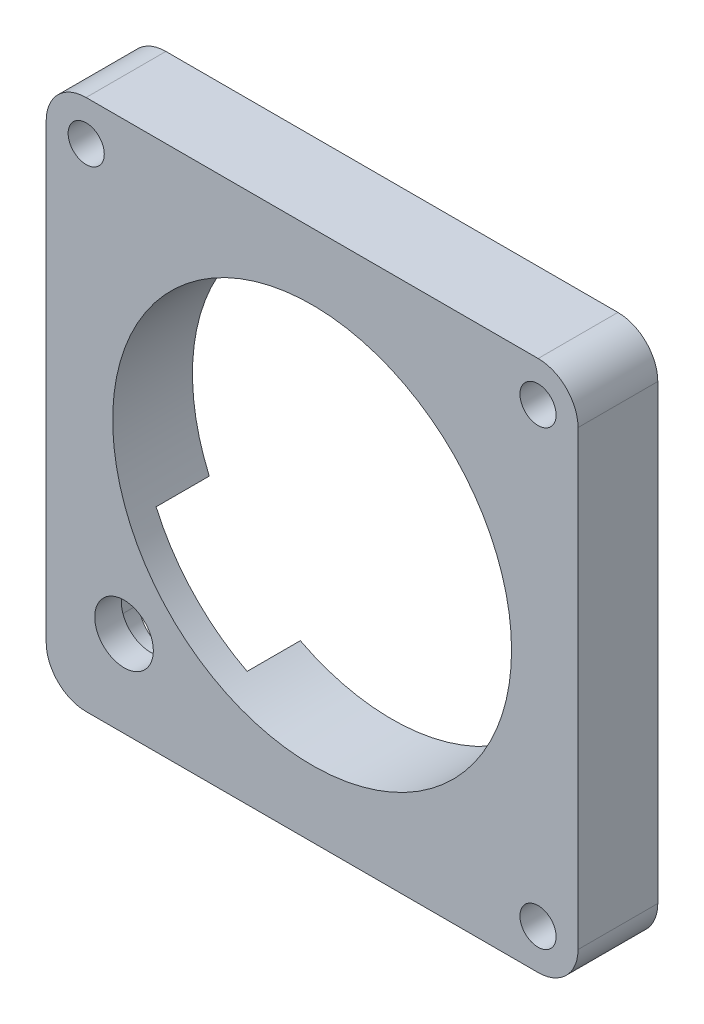
ISO-10303-21;
HEADER;
FILE_DESCRIPTION(('STEP AP214'),'2;1');
FILE_NAME('part.step','',(''),(''),'','','');
FILE_SCHEMA(('AUTOMOTIVE_DESIGN { 1 0 10303 214 1 1 1 1 }'));
ENDSEC;
DATA;
#1=APPLICATION_CONTEXT('core data for automotive mechanical design processes');
#2=APPLICATION_PROTOCOL_DEFINITION('international standard','automotive_design',2000,#1);
#3=PRODUCT_CONTEXT('',#1,'mechanical');
#4=PRODUCT('Part','Part','',(#3));
#5=PRODUCT_RELATED_PRODUCT_CATEGORY('part','',(#4));
#6=PRODUCT_DEFINITION_FORMATION('','',#4);
#7=PRODUCT_DEFINITION_CONTEXT('part definition',#1,'design');
#8=PRODUCT_DEFINITION('design','',#6,#7);
#9=PRODUCT_DEFINITION_SHAPE('','',#8);
#10=(LENGTH_UNIT() NAMED_UNIT(*) SI_UNIT(.MILLI.,.METRE.));
#11=(NAMED_UNIT(*) PLANE_ANGLE_UNIT() SI_UNIT($,.RADIAN.));
#12=(NAMED_UNIT(*) SI_UNIT($,.STERADIAN.) SOLID_ANGLE_UNIT());
#13=UNCERTAINTY_MEASURE_WITH_UNIT(LENGTH_MEASURE(1.E-05),#10,'distance_accuracy_value','');
#14=(GEOMETRIC_REPRESENTATION_CONTEXT(3) GLOBAL_UNCERTAINTY_ASSIGNED_CONTEXT((#13)) GLOBAL_UNIT_ASSIGNED_CONTEXT((#10,
#11,#12)) REPRESENTATION_CONTEXT('',''));
#15=CARTESIAN_POINT('',(0.,0.,0.));
#16=DIRECTION('',(0.,0.,1.));
#17=DIRECTION('',(1.,0.,0.));
#18=AXIS2_PLACEMENT_3D('',#15,#16,#17);
#19=CARTESIAN_POINT('',(-26.9748000000013,26.9748,9.52500000000001));
#20=DIRECTION('',(0.,0.,-1.));
#21=DIRECTION('',(-1.,0.,0.));
#22=AXIS2_PLACEMENT_3D('',#19,#20,#21);
#23=CYLINDRICAL_SURFACE('',#22,2.159);
#24=CARTESIAN_POINT('',(-26.9748000000013,26.9748,9.52500000000001));
#25=DIRECTION('',(0.,0.,1.));
#26=DIRECTION('',(1.,0.,0.));
#27=AXIS2_PLACEMENT_3D('',#24,#25,#26);
#28=CIRCLE('',#27,2.159);
#29=CARTESIAN_POINT('',(-24.8158000000013,26.9748,9.52500000000001));
#30=VERTEX_POINT('',#29);
#31=EDGE_CURVE('E261',#30,#30,#28,.T.);
#32=ORIENTED_EDGE('',*,*,#31,.T.);
#33=EDGE_LOOP('',(#32));
#34=FACE_BOUND('',#33,.T.);
#35=CARTESIAN_POINT('',(-26.9748000000013,26.9748,0.));
#36=DIRECTION('',(0.,0.,1.));
#37=DIRECTION('',(1.,0.,0.));
#38=AXIS2_PLACEMENT_3D('',#35,#36,#37);
#39=CIRCLE('',#38,2.159);
#40=CARTESIAN_POINT('',(-24.8158000000013,26.9748,0.));
#41=VERTEX_POINT('',#40);
#42=EDGE_CURVE('E258',#41,#41,#39,.T.);
#43=ORIENTED_EDGE('',*,*,#42,.F.);
#44=EDGE_LOOP('',(#43));
#45=FACE_BOUND('',#44,.T.);
#46=ADVANCED_FACE('F58',(#34,#45),#23,.F.);
#47=CARTESIAN_POINT('',(26.9748000000016,26.9747999999997,9.52500000000001));
#48=DIRECTION('',(0.,0.,-1.));
#49=DIRECTION('',(-1.,0.,0.));
#50=AXIS2_PLACEMENT_3D('',#47,#48,#49);
#51=CYLINDRICAL_SURFACE('',#50,2.15900000000011);
#52=CARTESIAN_POINT('',(26.9748000000016,26.9747999999997,9.52500000000001));
#53=DIRECTION('',(0.,0.,1.));
#54=DIRECTION('',(1.,0.,0.));
#55=AXIS2_PLACEMENT_3D('',#52,#53,#54);
#56=CIRCLE('',#55,2.15900000000011);
#57=CARTESIAN_POINT('',(29.1338000000017,26.9747999999997,9.52500000000001));
#58=VERTEX_POINT('',#57);
#59=EDGE_CURVE('E257',#58,#58,#56,.T.);
#60=ORIENTED_EDGE('',*,*,#59,.T.);
#61=EDGE_LOOP('',(#60));
#62=FACE_BOUND('',#61,.T.);
#63=CARTESIAN_POINT('',(26.9748000000016,26.9747999999997,0.));
#64=DIRECTION('',(0.,0.,1.));
#65=DIRECTION('',(1.,0.,0.));
#66=AXIS2_PLACEMENT_3D('',#63,#64,#65);
#67=CIRCLE('',#66,2.15900000000011);
#68=CARTESIAN_POINT('',(29.1338000000017,26.9747999999997,0.));
#69=VERTEX_POINT('',#68);
#70=EDGE_CURVE('E266',#69,#69,#67,.T.);
#71=ORIENTED_EDGE('',*,*,#70,.F.);
#72=EDGE_LOOP('',(#71));
#73=FACE_BOUND('',#72,.T.);
#74=ADVANCED_FACE('F328',(#62,#73),#51,.F.);
#75=CARTESIAN_POINT('',(26.9747999999981,-26.9748000000032,9.52500000000001));
#76=DIRECTION('',(0.,0.,-1.));
#77=DIRECTION('',(-1.,0.,0.));
#78=AXIS2_PLACEMENT_3D('',#75,#76,#77);
#79=CYLINDRICAL_SURFACE('',#78,2.159);
#80=CARTESIAN_POINT('',(26.9747999999981,-26.9748000000032,9.52500000000001));
#81=DIRECTION('',(0.,0.,1.));
#82=DIRECTION('',(1.,0.,0.));
#83=AXIS2_PLACEMENT_3D('',#80,#81,#82);
#84=CIRCLE('',#83,2.159);
#85=CARTESIAN_POINT('',(29.1337999999981,-26.9748000000032,9.52500000000001));
#86=VERTEX_POINT('',#85);
#87=EDGE_CURVE('E254',#86,#86,#84,.T.);
#88=ORIENTED_EDGE('',*,*,#87,.T.);
#89=EDGE_LOOP('',(#88));
#90=FACE_BOUND('',#89,.T.);
#91=CARTESIAN_POINT('',(26.9747999999981,-26.9748000000032,0.));
#92=DIRECTION('',(0.,0.,1.));
#93=DIRECTION('',(1.,0.,0.));
#94=AXIS2_PLACEMENT_3D('',#91,#92,#93);
#95=CIRCLE('',#94,2.159);
#96=CARTESIAN_POINT('',(29.1337999999981,-26.9748000000032,0.));
#97=VERTEX_POINT('',#96);
#98=EDGE_CURVE('E253',#97,#97,#95,.T.);
#99=ORIENTED_EDGE('',*,*,#98,.F.);
#100=EDGE_LOOP('',(#99));
#101=FACE_BOUND('',#100,.T.);
#102=ADVANCED_FACE('F60',(#90,#101),#79,.F.);
#103=CARTESIAN_POINT('',(0.,0.,9.52500000000001));
#104=DIRECTION('',(0.,0.,1.));
#105=DIRECTION('',(1.,0.,0.));
#106=AXIS2_PLACEMENT_3D('',#103,#104,#105);
#107=PLANE('',#106);
#108=CARTESIAN_POINT('',(-22.455957980456,-21.4503,9.52500000000001));
#109=DIRECTION('',(0.,0.,1.));
#110=DIRECTION('',(1.,0.,0.));
#111=AXIS2_PLACEMENT_3D('',#108,#109,#110);
#112=CIRCLE('',#111,3.5);
#113=CARTESIAN_POINT('',(-18.955957980456,-21.4503,9.52500000000001));
#114=VERTEX_POINT('',#113);
#115=EDGE_CURVE('E247',#114,#114,#112,.T.);
#116=ORIENTED_EDGE('',*,*,#115,.F.);
#117=EDGE_LOOP('',(#116));
#118=FACE_BOUND('',#117,.T.);
#119=ORIENTED_EDGE('',*,*,#87,.F.);
#120=EDGE_LOOP('',(#119));
#121=FACE_BOUND('',#120,.T.);
#122=ORIENTED_EDGE('',*,*,#59,.F.);
#123=EDGE_LOOP('',(#122));
#124=FACE_BOUND('',#123,.T.);
#125=ORIENTED_EDGE('',*,*,#31,.F.);
#126=EDGE_LOOP('',(#125));
#127=FACE_BOUND('',#126,.T.);
#128=CARTESIAN_POINT('',(0.,0.,9.52500000000001));
#129=DIRECTION('',(0.,0.,1.));
#130=DIRECTION('',(1.,0.,0.));
#131=AXIS2_PLACEMENT_3D('',#128,#129,#130);
#132=CIRCLE('',#131,23.8125);
#133=CARTESIAN_POINT('',(23.8125,0.,9.52500000000001));
#134=VERTEX_POINT('',#133);
#135=EDGE_CURVE('E250',#134,#134,#132,.T.);
#136=ORIENTED_EDGE('',*,*,#135,.F.);
#137=EDGE_LOOP('',(#136));
#138=FACE_BOUND('',#137,.T.);
#139=CARTESIAN_POINT('',(26.9875000000011,26.9875,9.52500000000001));
#140=DIRECTION('',(0.,0.,1.));
#141=DIRECTION('',(1.,0.,0.));
#142=AXIS2_PLACEMENT_3D('',#139,#140,#141);
#143=CIRCLE('',#142,4.7625);
#144=CARTESIAN_POINT('',(31.7500000000011,26.9875,9.52500000000001));
#145=VERTEX_POINT('',#144);
#146=CARTESIAN_POINT('',(26.9875000000011,31.75,9.52500000000001));
#147=VERTEX_POINT('',#146);
#148=EDGE_CURVE('E165',#145,#147,#143,.T.);
#149=ORIENTED_EDGE('',*,*,#148,.T.);
#150=DIRECTION('',(-1.,0.,0.));
#151=VECTOR('',#150,1.);
#152=CARTESIAN_POINT('',(26.9875000000011,31.75,9.52500000000001));
#153=LINE('',#152,#151);
#154=CARTESIAN_POINT('',(-26.9875000000011,31.75,9.52500000000001));
#155=VERTEX_POINT('',#154);
#156=EDGE_CURVE('E174',#147,#155,#153,.T.);
#157=ORIENTED_EDGE('',*,*,#156,.T.);
#158=CARTESIAN_POINT('',(-26.9875000000011,26.9875,9.52500000000001));
#159=DIRECTION('',(0.,0.,1.));
#160=DIRECTION('',(1.,0.,0.));
#161=AXIS2_PLACEMENT_3D('',#158,#159,#160);
#162=CIRCLE('',#161,4.7625);
#163=CARTESIAN_POINT('',(-31.7500000000011,26.9875,9.52500000000001));
#164=VERTEX_POINT('',#163);
#165=EDGE_CURVE('E180',#155,#164,#162,.T.);
#166=ORIENTED_EDGE('',*,*,#165,.T.);
#167=DIRECTION('',(0.,-1.,0.));
#168=VECTOR('',#167,1.);
#169=CARTESIAN_POINT('',(-31.7500000000011,26.9875,9.52500000000001));
#170=LINE('',#169,#168);
#171=CARTESIAN_POINT('',(-31.7500000000011,-26.9875,9.52500000000001));
#172=VERTEX_POINT('',#171);
#173=EDGE_CURVE('E193',#164,#172,#170,.T.);
#174=ORIENTED_EDGE('',*,*,#173,.T.);
#175=CARTESIAN_POINT('',(-26.9875000000011,-26.9875,9.52500000000001));
#176=DIRECTION('',(0.,0.,1.));
#177=DIRECTION('',(1.,0.,0.));
#178=AXIS2_PLACEMENT_3D('',#175,#176,#177);
#179=CIRCLE('',#178,4.7625);
#180=CARTESIAN_POINT('',(-26.9875000000011,-31.75,9.52500000000001));
#181=VERTEX_POINT('',#180);
#182=EDGE_CURVE('E196',#172,#181,#179,.T.);
#183=ORIENTED_EDGE('',*,*,#182,.T.);
#184=DIRECTION('',(1.,0.,0.));
#185=VECTOR('',#184,1.);
#186=CARTESIAN_POINT('',(-26.9875000000011,-31.75,9.52500000000001));
#187=LINE('',#186,#185);
#188=CARTESIAN_POINT('',(26.9875000000011,-31.75,9.52500000000001));
#189=VERTEX_POINT('',#188);
#190=EDGE_CURVE('E199',#181,#189,#187,.T.);
#191=ORIENTED_EDGE('',*,*,#190,.T.);
#192=CARTESIAN_POINT('',(26.9875000000011,-26.9875,9.52500000000001));
#193=DIRECTION('',(0.,0.,1.));
#194=DIRECTION('',(1.,0.,0.));
#195=AXIS2_PLACEMENT_3D('',#192,#193,#194);
#196=CIRCLE('',#195,4.7625);
#197=CARTESIAN_POINT('',(31.7500000000011,-26.9875,9.52500000000001));
#198=VERTEX_POINT('',#197);
#199=EDGE_CURVE('E202',#189,#198,#196,.T.);
#200=ORIENTED_EDGE('',*,*,#199,.T.);
#201=DIRECTION('',(0.,1.,0.));
#202=VECTOR('',#201,1.);
#203=CARTESIAN_POINT('',(31.7500000000011,-26.9875,9.52500000000001));
#204=LINE('',#203,#202);
#205=EDGE_CURVE('E171',#198,#145,#204,.T.);
#206=ORIENTED_EDGE('',*,*,#205,.T.);
#207=EDGE_LOOP('',(#149,#157,#166,#174,#183,#191,#200,#206));
#208=FACE_BOUND('',#207,.T.);
#209=ADVANCED_FACE('F182',(#118,#121,#124,#127,#138,#208),#107,.T.);
#210=CARTESIAN_POINT('',(0.,0.,0.));
#211=DIRECTION('',(0.,0.,1.));
#212=DIRECTION('',(1.,0.,0.));
#213=AXIS2_PLACEMENT_3D('',#210,#211,#212);
#214=PLANE('',#213);
#215=DIRECTION('',(0.707106781186544,0.707106781186551,0.));
#216=VECTOR('',#215,1.);
#217=CARTESIAN_POINT('',(-37.0488741771934,-24.817896045401,0.));
#218=LINE('',#217,#216);
#219=CARTESIAN_POINT('',(-30.1625000000011,-17.9315218682087,0.));
#220=VERTEX_POINT('',#219);
#221=CARTESIAN_POINT('',(-21.8036493025175,-9.57267117072496,0.));
#222=VERTEX_POINT('',#221);
#223=EDGE_CURVE('E219',#220,#222,#218,.T.);
#224=ORIENTED_EDGE('',*,*,#223,.F.);
#225=DIRECTION('',(0.,1.,0.));
#226=VECTOR('',#225,1.);
#227=CARTESIAN_POINT('',(-30.1625000000011,26.9875,0.));
#228=LINE('',#227,#226);
#229=CARTESIAN_POINT('',(-30.1625000000011,-26.9875,0.));
#230=VERTEX_POINT('',#229);
#231=EDGE_CURVE('E290',#230,#220,#228,.T.);
#232=ORIENTED_EDGE('',*,*,#231,.F.);
#233=CARTESIAN_POINT('',(-26.9875000000011,-26.9875,0.));
#234=DIRECTION('',(0.,0.,1.));
#235=DIRECTION('',(1.,0.,0.));
#236=AXIS2_PLACEMENT_3D('',#233,#234,#235);
#237=CIRCLE('',#236,3.175);
#238=CARTESIAN_POINT('',(-26.9875000000011,-30.1625,0.));
#239=VERTEX_POINT('',#238);
#240=EDGE_CURVE('E286',#239,#230,#237,.F.);
#241=ORIENTED_EDGE('',*,*,#240,.F.);
#242=DIRECTION('',(-1.,0.,0.));
#243=VECTOR('',#242,1.);
#244=CARTESIAN_POINT('',(-26.9875000000011,-30.1625,0.));
#245=LINE('',#244,#243);
#246=CARTESIAN_POINT('',(-19.9428378291196,-30.1625,0.));
#247=VERTEX_POINT('',#246);
#248=EDGE_CURVE('E284',#247,#239,#245,.T.);
#249=ORIENTED_EDGE('',*,*,#248,.F.);
#250=DIRECTION('',(-0.707106781186544,-0.707106781186551,0.));
#251=VECTOR('',#250,1.);
#252=CARTESIAN_POINT('',(-25.8235540258569,-36.0432161967374,0.));
#253=LINE('',#252,#251);
#254=CARTESIAN_POINT('',(-10.934083786039,-21.1537459569193,0.));
#255=VERTEX_POINT('',#254);
#256=EDGE_CURVE('E222',#255,#247,#253,.T.);
#257=ORIENTED_EDGE('',*,*,#256,.F.);
#258=CARTESIAN_POINT('',(0.,0.,0.));
#259=DIRECTION('',(0.,0.,-1.));
#260=DIRECTION('',(-1.,0.,0.));
#261=AXIS2_PLACEMENT_3D('',#258,#259,#260);
#262=CIRCLE('',#261,23.8125);
#263=EDGE_CURVE('E244',#222,#255,#262,.T.);
#264=ORIENTED_EDGE('',*,*,#263,.F.);
#265=EDGE_LOOP('',(#224,#232,#241,#249,#257,#264));
#266=FACE_BOUND('',#265,.T.);
#267=ORIENTED_EDGE('',*,*,#98,.T.);
#268=EDGE_LOOP('',(#267));
#269=FACE_BOUND('',#268,.T.);
#270=ORIENTED_EDGE('',*,*,#70,.T.);
#271=EDGE_LOOP('',(#270));
#272=FACE_BOUND('',#271,.T.);
#273=ORIENTED_EDGE('',*,*,#42,.T.);
#274=EDGE_LOOP('',(#273));
#275=FACE_BOUND('',#274,.T.);
#276=CARTESIAN_POINT('',(26.9875000000011,26.9875,0.));
#277=DIRECTION('',(0.,0.,1.));
#278=DIRECTION('',(1.,0.,0.));
#279=AXIS2_PLACEMENT_3D('',#276,#277,#278);
#280=CIRCLE('',#279,4.7625);
#281=CARTESIAN_POINT('',(26.9875000000011,31.75,0.));
#282=VERTEX_POINT('',#281);
#283=CARTESIAN_POINT('',(31.7500000000011,26.9875,0.));
#284=VERTEX_POINT('',#283);
#285=EDGE_CURVE('E167',#282,#284,#280,.F.);
#286=ORIENTED_EDGE('',*,*,#285,.T.);
#287=DIRECTION('',(0.,-1.,0.));
#288=VECTOR('',#287,1.);
#289=CARTESIAN_POINT('',(31.7500000000011,-26.9875,0.));
#290=LINE('',#289,#288);
#291=CARTESIAN_POINT('',(31.7500000000011,-26.9875,0.));
#292=VERTEX_POINT('',#291);
#293=EDGE_CURVE('E292',#284,#292,#290,.T.);
#294=ORIENTED_EDGE('',*,*,#293,.T.);
#295=CARTESIAN_POINT('',(26.9875000000011,-26.9875,0.));
#296=DIRECTION('',(0.,0.,1.));
#297=DIRECTION('',(1.,0.,0.));
#298=AXIS2_PLACEMENT_3D('',#295,#296,#297);
#299=CIRCLE('',#298,4.7625);
#300=CARTESIAN_POINT('',(26.9875000000011,-31.75,0.));
#301=VERTEX_POINT('',#300);
#302=EDGE_CURVE('E304',#292,#301,#299,.F.);
#303=ORIENTED_EDGE('',*,*,#302,.T.);
#304=DIRECTION('',(-1.,0.,0.));
#305=VECTOR('',#304,1.);
#306=CARTESIAN_POINT('',(-26.9875000000011,-31.75,0.));
#307=LINE('',#306,#305);
#308=CARTESIAN_POINT('',(-26.9875000000011,-31.75,0.));
#309=VERTEX_POINT('',#308);
#310=EDGE_CURVE('E302',#301,#309,#307,.T.);
#311=ORIENTED_EDGE('',*,*,#310,.T.);
#312=CARTESIAN_POINT('',(-26.9875000000011,-26.9875,0.));
#313=DIRECTION('',(0.,0.,1.));
#314=DIRECTION('',(1.,0.,0.));
#315=AXIS2_PLACEMENT_3D('',#312,#313,#314);
#316=CIRCLE('',#315,4.7625);
#317=CARTESIAN_POINT('',(-31.7500000000011,-26.9875,0.));
#318=VERTEX_POINT('',#317);
#319=EDGE_CURVE('E300',#309,#318,#316,.F.);
#320=ORIENTED_EDGE('',*,*,#319,.T.);
#321=DIRECTION('',(0.,1.,0.));
#322=VECTOR('',#321,1.);
#323=CARTESIAN_POINT('',(-31.7500000000011,26.9875,0.));
#324=LINE('',#323,#322);
#325=CARTESIAN_POINT('',(-31.7500000000011,26.9875,0.));
#326=VERTEX_POINT('',#325);
#327=EDGE_CURVE('E298',#318,#326,#324,.T.);
#328=ORIENTED_EDGE('',*,*,#327,.T.);
#329=CARTESIAN_POINT('',(-26.9875000000011,26.9875,0.));
#330=DIRECTION('',(0.,0.,1.));
#331=DIRECTION('',(1.,0.,0.));
#332=AXIS2_PLACEMENT_3D('',#329,#330,#331);
#333=CIRCLE('',#332,4.7625);
#334=CARTESIAN_POINT('',(-26.9875000000011,31.75,0.));
#335=VERTEX_POINT('',#334);
#336=EDGE_CURVE('E207',#326,#335,#333,.F.);
#337=ORIENTED_EDGE('',*,*,#336,.T.);
#338=DIRECTION('',(1.,0.,0.));
#339=VECTOR('',#338,1.);
#340=CARTESIAN_POINT('',(26.9875000000011,31.75,0.));
#341=LINE('',#340,#339);
#342=EDGE_CURVE('E224',#335,#282,#341,.T.);
#343=ORIENTED_EDGE('',*,*,#342,.T.);
#344=EDGE_LOOP('',(#286,#294,#303,#311,#320,#328,#337,#343));
#345=FACE_BOUND('',#344,.T.);
#346=ADVANCED_FACE('F281',(#266,#269,#272,#275,#345),#214,.F.);
#347=CARTESIAN_POINT('',(0.,0.,7.93749999999999));
#348=DIRECTION('',(0.,0.,1.));
#349=DIRECTION('',(1.,0.,0.));
#350=AXIS2_PLACEMENT_3D('',#347,#348,#349);
#351=CYLINDRICAL_SURFACE('',#350,23.8125);
#352=ORIENTED_EDGE('',*,*,#135,.T.);
#353=EDGE_LOOP('',(#352));
#354=FACE_BOUND('',#353,.T.);
#355=CARTESIAN_POINT('',(0.,0.,6.34999999999999));
#356=DIRECTION('',(0.,0.,1.));
#357=DIRECTION('',(1.,0.,0.));
#358=AXIS2_PLACEMENT_3D('',#355,#356,#357);
#359=CIRCLE('',#358,23.8125);
#360=CARTESIAN_POINT('',(-10.934083786039,-21.1537459569193,6.34999999999999));
#361=VERTEX_POINT('',#360);
#362=CARTESIAN_POINT('',(-21.8036493025175,-9.57267117072495,6.34999999999999));
#363=VERTEX_POINT('',#362);
#364=EDGE_CURVE('E229',#361,#363,#359,.F.);
#365=ORIENTED_EDGE('',*,*,#364,.T.);
#366=DIRECTION('',(0.,0.,1.));
#367=VECTOR('',#366,1.);
#368=CARTESIAN_POINT('',(-21.8036493025175,-9.57267117072496,7.93749999999999));
#369=LINE('',#368,#367);
#370=EDGE_CURVE('E15',#363,#222,#369,.F.);
#371=ORIENTED_EDGE('',*,*,#370,.T.);
#372=ORIENTED_EDGE('',*,*,#263,.T.);
#373=DIRECTION('',(0.,0.,1.));
#374=VECTOR('',#373,1.);
#375=CARTESIAN_POINT('',(-10.934083786039,-21.1537459569193,7.93749999999999));
#376=LINE('',#375,#374);
#377=EDGE_CURVE('E66',#255,#361,#376,.T.);
#378=ORIENTED_EDGE('',*,*,#377,.T.);
#379=EDGE_LOOP('',(#365,#371,#372,#378));
#380=FACE_BOUND('',#379,.T.);
#381=ADVANCED_FACE('F274',(#354,#380),#351,.F.);
#382=CARTESIAN_POINT('',(-22.455957980456,-21.4503,9.52500000000001));
#383=DIRECTION('',(0.,0.,1.));
#384=DIRECTION('',(1.,0.,0.));
#385=AXIS2_PLACEMENT_3D('',#382,#383,#384);
#386=CYLINDRICAL_SURFACE('',#385,3.5);
#387=CARTESIAN_POINT('',(-22.455957980456,-21.4503,6.34999999999999));
#388=DIRECTION('',(0.,0.,1.));
#389=DIRECTION('',(1.,0.,0.));
#390=AXIS2_PLACEMENT_3D('',#387,#388,#389);
#391=CIRCLE('',#390,3.5);
#392=CARTESIAN_POINT('',(-18.955957980456,-21.4503,6.34999999999999));
#393=VERTEX_POINT('',#392);
#394=EDGE_CURVE('E226',#393,#393,#391,.F.);
#395=ORIENTED_EDGE('',*,*,#394,.T.);
#396=EDGE_LOOP('',(#395));
#397=FACE_BOUND('',#396,.T.);
#398=ORIENTED_EDGE('',*,*,#115,.T.);
#399=EDGE_LOOP('',(#398));
#400=FACE_BOUND('',#399,.T.);
#401=ADVANCED_FACE('F344',(#397,#400),#386,.F.);
#402=CARTESIAN_POINT('',(-37.0488741771934,-24.817896045401,50.8));
#403=DIRECTION('',(-0.707106781186551,0.707106781186544,0.));
#404=DIRECTION('',(-0.707106781186544,-0.707106781186551,0.));
#405=AXIS2_PLACEMENT_3D('',#402,#403,#404);
#406=PLANE('',#405);
#407=ORIENTED_EDGE('',*,*,#223,.T.);
#408=ORIENTED_EDGE('',*,*,#370,.F.);
#409=DIRECTION('',(0.707106781186544,0.707106781186551,0.));
#410=VECTOR('',#409,1.);
#411=CARTESIAN_POINT('',(-37.0488741771934,-24.817896045401,6.34999999999999));
#412=LINE('',#411,#410);
#413=CARTESIAN_POINT('',(-30.1625000000011,-17.9315218682087,6.34999999999999));
#414=VERTEX_POINT('',#413);
#415=EDGE_CURVE('E221',#414,#363,#412,.T.);
#416=ORIENTED_EDGE('',*,*,#415,.F.);
#417=DIRECTION('',(0.,0.,1.));
#418=VECTOR('',#417,1.);
#419=CARTESIAN_POINT('',(-30.1625000000011,-17.9315218682087,9.52500000000001));
#420=LINE('',#419,#418);
#421=EDGE_CURVE('E241',#220,#414,#420,.T.);
#422=ORIENTED_EDGE('',*,*,#421,.F.);
#423=EDGE_LOOP('',(#407,#408,#416,#422));
#424=FACE_BOUND('',#423,.T.);
#425=ADVANCED_FACE('F348',(#424),#406,.F.);
#426=CARTESIAN_POINT('',(-25.8235540258569,-36.0432161967374,50.8));
#427=DIRECTION('',(0.707106781186551,-0.707106781186544,0.));
#428=DIRECTION('',(0.707106781186544,0.707106781186551,0.));
#429=AXIS2_PLACEMENT_3D('',#426,#427,#428);
#430=PLANE('',#429);
#431=DIRECTION('',(-0.707106781186544,-0.707106781186551,0.));
#432=VECTOR('',#431,1.);
#433=CARTESIAN_POINT('',(-25.8235540258569,-36.0432161967374,6.34999999999999));
#434=LINE('',#433,#432);
#435=CARTESIAN_POINT('',(-19.9428378291196,-30.1625,6.34999999999999));
#436=VERTEX_POINT('',#435);
#437=EDGE_CURVE('E73',#361,#436,#434,.T.);
#438=ORIENTED_EDGE('',*,*,#437,.F.);
#439=ORIENTED_EDGE('',*,*,#377,.F.);
#440=ORIENTED_EDGE('',*,*,#256,.T.);
#441=DIRECTION('',(0.,0.,-1.));
#442=VECTOR('',#441,1.);
#443=CARTESIAN_POINT('',(-19.9428378291196,-30.1625,9.52500000000001));
#444=LINE('',#443,#442);
#445=EDGE_CURVE('E238',#436,#247,#444,.T.);
#446=ORIENTED_EDGE('',*,*,#445,.F.);
#447=EDGE_LOOP('',(#438,#439,#440,#446));
#448=FACE_BOUND('',#447,.T.);
#449=ADVANCED_FACE('F277',(#448),#430,.F.);
#450=CARTESIAN_POINT('',(0.,0.,6.34999999999999));
#451=DIRECTION('',(0.,0.,1.));
#452=DIRECTION('',(1.,0.,0.));
#453=AXIS2_PLACEMENT_3D('',#450,#451,#452);
#454=PLANE('',#453);
#455=ORIENTED_EDGE('',*,*,#394,.F.);
#456=EDGE_LOOP('',(#455));
#457=FACE_BOUND('',#456,.T.);
#458=ORIENTED_EDGE('',*,*,#415,.T.);
#459=ORIENTED_EDGE('',*,*,#364,.F.);
#460=ORIENTED_EDGE('',*,*,#437,.T.);
#461=DIRECTION('',(1.,0.,0.));
#462=VECTOR('',#461,1.);
#463=CARTESIAN_POINT('',(0.,-30.1625,6.34999999999999));
#464=LINE('',#463,#462);
#465=CARTESIAN_POINT('',(-26.9875000000011,-30.1625,6.34999999999999));
#466=VERTEX_POINT('',#465);
#467=EDGE_CURVE('E232',#466,#436,#464,.T.);
#468=ORIENTED_EDGE('',*,*,#467,.F.);
#469=CARTESIAN_POINT('',(-26.9875000000011,-26.9875,6.34999999999999));
#470=DIRECTION('',(0.,0.,1.));
#471=DIRECTION('',(1.,0.,0.));
#472=AXIS2_PLACEMENT_3D('',#469,#470,#471);
#473=CIRCLE('',#472,3.175);
#474=CARTESIAN_POINT('',(-30.1625000000011,-26.9875,6.34999999999999));
#475=VERTEX_POINT('',#474);
#476=EDGE_CURVE('E81',#466,#475,#473,.F.);
#477=ORIENTED_EDGE('',*,*,#476,.T.);
#478=DIRECTION('',(0.,-1.,0.));
#479=VECTOR('',#478,1.);
#480=CARTESIAN_POINT('',(-30.1625000000011,0.,6.34999999999999));
#481=LINE('',#480,#479);
#482=EDGE_CURVE('E236',#414,#475,#481,.T.);
#483=ORIENTED_EDGE('',*,*,#482,.F.);
#484=EDGE_LOOP('',(#458,#459,#460,#468,#477,#483));
#485=FACE_BOUND('',#484,.T.);
#486=ADVANCED_FACE('F350',(#457,#485),#454,.F.);
#487=CARTESIAN_POINT('',(-30.1625000000011,26.9875,-89.8025612106931));
#488=DIRECTION('',(-1.,0.,0.));
#489=DIRECTION('',(0.,0.,1.));
#490=AXIS2_PLACEMENT_3D('',#487,#488,#489);
#491=PLANE('',#490);
#492=ORIENTED_EDGE('',*,*,#231,.T.);
#493=ORIENTED_EDGE('',*,*,#421,.T.);
#494=ORIENTED_EDGE('',*,*,#482,.T.);
#495=DIRECTION('',(0.,0.,1.));
#496=VECTOR('',#495,1.);
#497=CARTESIAN_POINT('',(-30.1625000000011,-26.9875,-89.8025612106931));
#498=LINE('',#497,#496);
#499=EDGE_CURVE('E188',#230,#475,#498,.T.);
#500=ORIENTED_EDGE('',*,*,#499,.F.);
#501=EDGE_LOOP('',(#492,#493,#494,#500));
#502=FACE_BOUND('',#501,.T.);
#503=ADVANCED_FACE('F353',(#502),#491,.F.);
#504=CARTESIAN_POINT('',(-26.9875000000011,-26.9875,-89.8025612106931));
#505=DIRECTION('',(0.,0.,1.));
#506=DIRECTION('',(1.,0.,0.));
#507=AXIS2_PLACEMENT_3D('',#504,#505,#506);
#508=CYLINDRICAL_SURFACE('',#507,3.175);
#509=ORIENTED_EDGE('',*,*,#499,.T.);
#510=ORIENTED_EDGE('',*,*,#476,.F.);
#511=DIRECTION('',(0.,0.,1.));
#512=VECTOR('',#511,1.);
#513=CARTESIAN_POINT('',(-26.9875000000011,-30.1625,-89.8025612106931));
#514=LINE('',#513,#512);
#515=EDGE_CURVE('E185',#239,#466,#514,.T.);
#516=ORIENTED_EDGE('',*,*,#515,.F.);
#517=ORIENTED_EDGE('',*,*,#240,.T.);
#518=EDGE_LOOP('',(#509,#510,#516,#517));
#519=FACE_BOUND('',#518,.T.);
#520=ADVANCED_FACE('F420',(#519),#508,.F.);
#521=CARTESIAN_POINT('',(-26.9875000000011,-30.1625,-89.8025612106931));
#522=DIRECTION('',(0.,-1.,0.));
#523=DIRECTION('',(0.,0.,-1.));
#524=AXIS2_PLACEMENT_3D('',#521,#522,#523);
#525=PLANE('',#524);
#526=ORIENTED_EDGE('',*,*,#467,.T.);
#527=ORIENTED_EDGE('',*,*,#445,.T.);
#528=ORIENTED_EDGE('',*,*,#248,.T.);
#529=ORIENTED_EDGE('',*,*,#515,.T.);
#530=EDGE_LOOP('',(#526,#527,#528,#529));
#531=FACE_BOUND('',#530,.T.);
#532=ADVANCED_FACE('F363',(#531),#525,.F.);
#533=CARTESIAN_POINT('',(26.9875000000011,31.75,-89.8025612106931));
#534=DIRECTION('',(0.,1.,0.));
#535=DIRECTION('',(0.,0.,1.));
#536=AXIS2_PLACEMENT_3D('',#533,#534,#535);
#537=PLANE('',#536);
#538=ORIENTED_EDGE('',*,*,#342,.F.);
#539=DIRECTION('',(0.,0.,1.));
#540=VECTOR('',#539,1.);
#541=CARTESIAN_POINT('',(-26.9875000000011,31.75,-89.8025612106931));
#542=LINE('',#541,#540);
#543=EDGE_CURVE('E170',#335,#155,#542,.T.);
#544=ORIENTED_EDGE('',*,*,#543,.T.);
#545=ORIENTED_EDGE('',*,*,#156,.F.);
#546=DIRECTION('',(0.,0.,1.));
#547=VECTOR('',#546,1.);
#548=CARTESIAN_POINT('',(26.9875000000011,31.75,-89.8025612106931));
#549=LINE('',#548,#547);
#550=EDGE_CURVE('E160',#282,#147,#549,.T.);
#551=ORIENTED_EDGE('',*,*,#550,.F.);
#552=EDGE_LOOP('',(#538,#544,#545,#551));
#553=FACE_BOUND('',#552,.T.);
#554=ADVANCED_FACE('F175',(#553),#537,.T.);
#555=CARTESIAN_POINT('',(-26.9875000000011,26.9875,-89.8025612106931));
#556=DIRECTION('',(0.,0.,1.));
#557=DIRECTION('',(1.,0.,0.));
#558=AXIS2_PLACEMENT_3D('',#555,#556,#557);
#559=CYLINDRICAL_SURFACE('',#558,4.7625);
#560=ORIENTED_EDGE('',*,*,#336,.F.);
#561=DIRECTION('',(0.,0.,1.));
#562=VECTOR('',#561,1.);
#563=CARTESIAN_POINT('',(-31.7500000000011,26.9875,-89.8025612106931));
#564=LINE('',#563,#562);
#565=EDGE_CURVE('E216',#326,#164,#564,.T.);
#566=ORIENTED_EDGE('',*,*,#565,.T.);
#567=ORIENTED_EDGE('',*,*,#165,.F.);
#568=ORIENTED_EDGE('',*,*,#543,.F.);
#569=EDGE_LOOP('',(#560,#566,#567,#568));
#570=FACE_BOUND('',#569,.T.);
#571=ADVANCED_FACE('F362',(#570),#559,.T.);
#572=CARTESIAN_POINT('',(-31.7500000000011,26.9875,-89.8025612106931));
#573=DIRECTION('',(-1.,0.,0.));
#574=DIRECTION('',(0.,0.,1.));
#575=AXIS2_PLACEMENT_3D('',#572,#573,#574);
#576=PLANE('',#575);
#577=ORIENTED_EDGE('',*,*,#327,.F.);
#578=DIRECTION('',(0.,0.,1.));
#579=VECTOR('',#578,1.);
#580=CARTESIAN_POINT('',(-31.7500000000011,-26.9875,-89.8025612106931));
#581=LINE('',#580,#579);
#582=EDGE_CURVE('E214',#318,#172,#581,.T.);
#583=ORIENTED_EDGE('',*,*,#582,.T.);
#584=ORIENTED_EDGE('',*,*,#173,.F.);
#585=ORIENTED_EDGE('',*,*,#565,.F.);
#586=EDGE_LOOP('',(#577,#583,#584,#585));
#587=FACE_BOUND('',#586,.T.);
#588=ADVANCED_FACE('F366',(#587),#576,.T.);
#589=CARTESIAN_POINT('',(-26.9875000000011,-26.9875,-89.8025612106931));
#590=DIRECTION('',(0.,0.,1.));
#591=DIRECTION('',(1.,0.,0.));
#592=AXIS2_PLACEMENT_3D('',#589,#590,#591);
#593=CYLINDRICAL_SURFACE('',#592,4.7625);
#594=ORIENTED_EDGE('',*,*,#319,.F.);
#595=DIRECTION('',(0.,0.,1.));
#596=VECTOR('',#595,1.);
#597=CARTESIAN_POINT('',(-26.9875000000011,-31.75,-89.8025612106931));
#598=LINE('',#597,#596);
#599=EDGE_CURVE('E212',#309,#181,#598,.T.);
#600=ORIENTED_EDGE('',*,*,#599,.T.);
#601=ORIENTED_EDGE('',*,*,#182,.F.);
#602=ORIENTED_EDGE('',*,*,#582,.F.);
#603=EDGE_LOOP('',(#594,#600,#601,#602));
#604=FACE_BOUND('',#603,.T.);
#605=ADVANCED_FACE('F370',(#604),#593,.T.);
#606=CARTESIAN_POINT('',(-26.9875000000011,-31.75,-89.8025612106931));
#607=DIRECTION('',(0.,-1.,0.));
#608=DIRECTION('',(0.,0.,-1.));
#609=AXIS2_PLACEMENT_3D('',#606,#607,#608);
#610=PLANE('',#609);
#611=ORIENTED_EDGE('',*,*,#310,.F.);
#612=DIRECTION('',(0.,0.,1.));
#613=VECTOR('',#612,1.);
#614=CARTESIAN_POINT('',(26.9875000000011,-31.75,-89.8025612106931));
#615=LINE('',#614,#613);
#616=EDGE_CURVE('E210',#301,#189,#615,.T.);
#617=ORIENTED_EDGE('',*,*,#616,.T.);
#618=ORIENTED_EDGE('',*,*,#190,.F.);
#619=ORIENTED_EDGE('',*,*,#599,.F.);
#620=EDGE_LOOP('',(#611,#617,#618,#619));
#621=FACE_BOUND('',#620,.T.);
#622=ADVANCED_FACE('F324',(#621),#610,.T.);
#623=CARTESIAN_POINT('',(26.9875000000011,-26.9875,-89.8025612106931));
#624=DIRECTION('',(0.,0.,1.));
#625=DIRECTION('',(1.,0.,0.));
#626=AXIS2_PLACEMENT_3D('',#623,#624,#625);
#627=CYLINDRICAL_SURFACE('',#626,4.7625);
#628=ORIENTED_EDGE('',*,*,#302,.F.);
#629=DIRECTION('',(0.,0.,1.));
#630=VECTOR('',#629,1.);
#631=CARTESIAN_POINT('',(31.7500000000011,-26.9875,-89.8025612106931));
#632=LINE('',#631,#630);
#633=EDGE_CURVE('E208',#292,#198,#632,.T.);
#634=ORIENTED_EDGE('',*,*,#633,.T.);
#635=ORIENTED_EDGE('',*,*,#199,.F.);
#636=ORIENTED_EDGE('',*,*,#616,.F.);
#637=EDGE_LOOP('',(#628,#634,#635,#636));
#638=FACE_BOUND('',#637,.T.);
#639=ADVANCED_FACE('F314',(#638),#627,.T.);
#640=CARTESIAN_POINT('',(31.7500000000011,-26.9875,-89.8025612106931));
#641=DIRECTION('',(1.,0.,0.));
#642=DIRECTION('',(0.,0.,-1.));
#643=AXIS2_PLACEMENT_3D('',#640,#641,#642);
#644=PLANE('',#643);
#645=ORIENTED_EDGE('',*,*,#293,.F.);
#646=DIRECTION('',(0.,0.,1.));
#647=VECTOR('',#646,1.);
#648=CARTESIAN_POINT('',(31.7500000000011,26.9875,-89.8025612106931));
#649=LINE('',#648,#647);
#650=EDGE_CURVE('E205',#284,#145,#649,.T.);
#651=ORIENTED_EDGE('',*,*,#650,.T.);
#652=ORIENTED_EDGE('',*,*,#205,.F.);
#653=ORIENTED_EDGE('',*,*,#633,.F.);
#654=EDGE_LOOP('',(#645,#651,#652,#653));
#655=FACE_BOUND('',#654,.T.);
#656=ADVANCED_FACE('F316',(#655),#644,.T.);
#657=CARTESIAN_POINT('',(26.9875000000011,26.9875,-89.8025612106931));
#658=DIRECTION('',(0.,0.,1.));
#659=DIRECTION('',(1.,0.,0.));
#660=AXIS2_PLACEMENT_3D('',#657,#658,#659);
#661=CYLINDRICAL_SURFACE('',#660,4.7625);
#662=ORIENTED_EDGE('',*,*,#285,.F.);
#663=ORIENTED_EDGE('',*,*,#550,.T.);
#664=ORIENTED_EDGE('',*,*,#148,.F.);
#665=ORIENTED_EDGE('',*,*,#650,.F.);
#666=EDGE_LOOP('',(#662,#663,#664,#665));
#667=FACE_BOUND('',#666,.T.);
#668=ADVANCED_FACE('F162',(#667),#661,.T.);
#669=CLOSED_SHELL('',(#46,#74,#102,#209,#346,#381,#401,#425,#449,#486,#503,#520,#532,#554,#571,
#588,#605,#622,#639,#656,#668));
#670=MANIFOLD_SOLID_BREP('B2',#669);
#671=ADVANCED_BREP_SHAPE_REPRESENTATION('',(#18,#670),#14);
#672=SHAPE_DEFINITION_REPRESENTATION(#9,#671);
ENDSEC;
END-ISO-10303-21;
